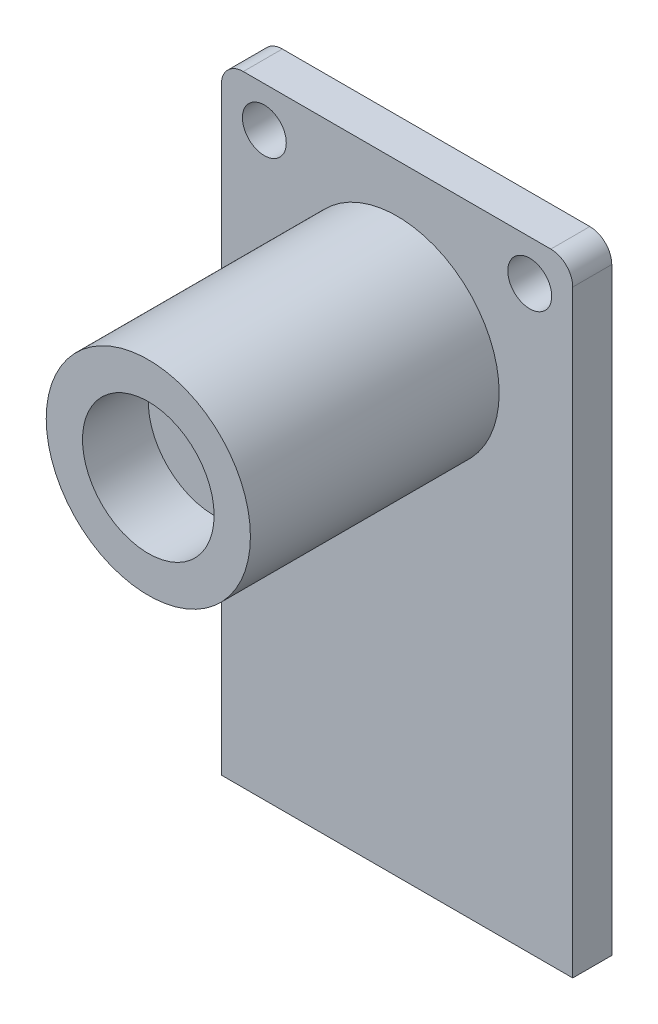
ISO-10303-21;
HEADER;
FILE_DESCRIPTION(('STEP AP214'),'2;1');
FILE_NAME('part.step','',(''),(''),'','','');
FILE_SCHEMA(('AUTOMOTIVE_DESIGN { 1 0 10303 214 1 1 1 1 }'));
ENDSEC;
DATA;
#1=APPLICATION_CONTEXT('core data for automotive mechanical design processes');
#2=APPLICATION_PROTOCOL_DEFINITION('international standard','automotive_design',2000,#1);
#3=PRODUCT_CONTEXT('',#1,'mechanical');
#4=PRODUCT('Part','Part','',(#3));
#5=PRODUCT_RELATED_PRODUCT_CATEGORY('part','',(#4));
#6=PRODUCT_DEFINITION_FORMATION('','',#4);
#7=PRODUCT_DEFINITION_CONTEXT('part definition',#1,'design');
#8=PRODUCT_DEFINITION('design','',#6,#7);
#9=PRODUCT_DEFINITION_SHAPE('','',#8);
#10=(LENGTH_UNIT() NAMED_UNIT(*) SI_UNIT(.MILLI.,.METRE.));
#11=(NAMED_UNIT(*) PLANE_ANGLE_UNIT() SI_UNIT($,.RADIAN.));
#12=(NAMED_UNIT(*) SI_UNIT($,.STERADIAN.) SOLID_ANGLE_UNIT());
#13=UNCERTAINTY_MEASURE_WITH_UNIT(LENGTH_MEASURE(1.E-05),#10,'distance_accuracy_value','');
#14=(GEOMETRIC_REPRESENTATION_CONTEXT(3) GLOBAL_UNCERTAINTY_ASSIGNED_CONTEXT((#13)) GLOBAL_UNIT_ASSIGNED_CONTEXT((#10,
#11,#12)) REPRESENTATION_CONTEXT('',''));
#15=CARTESIAN_POINT('',(0.,0.,0.));
#16=DIRECTION('',(0.,0.,1.));
#17=DIRECTION('',(1.,0.,0.));
#18=AXIS2_PLACEMENT_3D('',#15,#16,#17);
#19=CARTESIAN_POINT('',(8.01,-14.14,1.78));
#20=DIRECTION('',(-1.,0.,0.));
#21=DIRECTION('',(0.,0.,1.));
#22=AXIS2_PLACEMENT_3D('',#19,#20,#21);
#23=PLANE('',#22);
#24=DIRECTION('',(0.,1.,0.));
#25=VECTOR('',#24,1.);
#26=CARTESIAN_POINT('',(8.01,-14.14,0.));
#27=LINE('',#26,#25);
#28=CARTESIAN_POINT('',(8.01,-14.14,0.));
#29=VERTEX_POINT('',#28);
#30=CARTESIAN_POINT('',(8.01,13.14,0.));
#31=VERTEX_POINT('',#30);
#32=EDGE_CURVE('E120',#29,#31,#27,.T.);
#33=ORIENTED_EDGE('',*,*,#32,.T.);
#34=DIRECTION('',(0.,0.,-1.));
#35=VECTOR('',#34,1.);
#36=CARTESIAN_POINT('',(8.01,13.14,1.78));
#37=LINE('',#36,#35);
#38=CARTESIAN_POINT('',(8.01,13.14,1.78));
#39=VERTEX_POINT('',#38);
#40=EDGE_CURVE('E11',#39,#31,#37,.T.);
#41=ORIENTED_EDGE('',*,*,#40,.F.);
#42=DIRECTION('',(0.,1.,0.));
#43=VECTOR('',#42,1.);
#44=CARTESIAN_POINT('',(8.01,-14.14,1.78));
#45=LINE('',#44,#43);
#46=CARTESIAN_POINT('',(8.01,-14.14,1.78));
#47=VERTEX_POINT('',#46);
#48=EDGE_CURVE('E131',#47,#39,#45,.T.);
#49=ORIENTED_EDGE('',*,*,#48,.F.);
#50=DIRECTION('',(0.,0.,-1.));
#51=VECTOR('',#50,1.);
#52=CARTESIAN_POINT('',(8.01,-14.14,1.78));
#53=LINE('',#52,#51);
#54=EDGE_CURVE('E116',#47,#29,#53,.T.);
#55=ORIENTED_EDGE('',*,*,#54,.T.);
#56=EDGE_LOOP('',(#33,#41,#49,#55));
#57=FACE_BOUND('',#56,.T.);
#58=ADVANCED_FACE('F34',(#57),#23,.F.);
#59=CARTESIAN_POINT('',(7.01,13.14,1.78));
#60=DIRECTION('',(0.,0.,-1.));
#61=DIRECTION('',(-1.,0.,0.));
#62=AXIS2_PLACEMENT_3D('',#59,#60,#61);
#63=CYLINDRICAL_SURFACE('',#62,1.);
#64=CARTESIAN_POINT('',(7.01,13.14,0.));
#65=DIRECTION('',(0.,0.,1.));
#66=DIRECTION('',(1.,0.,0.));
#67=AXIS2_PLACEMENT_3D('',#64,#65,#66);
#68=CIRCLE('',#67,1.);
#69=CARTESIAN_POINT('',(7.00999999999999,14.14,0.));
#70=VERTEX_POINT('',#69);
#71=EDGE_CURVE('E123',#31,#70,#68,.T.);
#72=ORIENTED_EDGE('',*,*,#71,.T.);
#73=DIRECTION('',(0.,0.,-1.));
#74=VECTOR('',#73,1.);
#75=CARTESIAN_POINT('',(7.00999999999999,14.14,1.78));
#76=LINE('',#75,#74);
#77=CARTESIAN_POINT('',(7.00999999999999,14.14,1.78));
#78=VERTEX_POINT('',#77);
#79=EDGE_CURVE('E43',#78,#70,#76,.T.);
#80=ORIENTED_EDGE('',*,*,#79,.F.);
#81=CARTESIAN_POINT('',(7.01,13.14,1.78));
#82=DIRECTION('',(0.,0.,1.));
#83=DIRECTION('',(1.,0.,0.));
#84=AXIS2_PLACEMENT_3D('',#81,#82,#83);
#85=CIRCLE('',#84,1.);
#86=EDGE_CURVE('E89',#39,#78,#85,.T.);
#87=ORIENTED_EDGE('',*,*,#86,.F.);
#88=ORIENTED_EDGE('',*,*,#40,.T.);
#89=EDGE_LOOP('',(#72,#80,#87,#88));
#90=FACE_BOUND('',#89,.T.);
#91=ADVANCED_FACE('F164',(#90),#63,.T.);
#92=CARTESIAN_POINT('',(7.00999999999999,14.14,1.78));
#93=DIRECTION('',(0.,-1.,0.));
#94=DIRECTION('',(1.,0.,0.));
#95=AXIS2_PLACEMENT_3D('',#92,#93,#94);
#96=PLANE('',#95);
#97=DIRECTION('',(-1.,0.,0.));
#98=VECTOR('',#97,1.);
#99=CARTESIAN_POINT('',(7.00999999999999,14.14,0.));
#100=LINE('',#99,#98);
#101=CARTESIAN_POINT('',(-7.00999999999999,14.14,0.));
#102=VERTEX_POINT('',#101);
#103=EDGE_CURVE('E126',#70,#102,#100,.T.);
#104=ORIENTED_EDGE('',*,*,#103,.T.);
#105=DIRECTION('',(0.,0.,-1.));
#106=VECTOR('',#105,1.);
#107=CARTESIAN_POINT('',(-7.00999999999999,14.14,1.78));
#108=LINE('',#107,#106);
#109=CARTESIAN_POINT('',(-7.00999999999999,14.14,1.78));
#110=VERTEX_POINT('',#109);
#111=EDGE_CURVE('E111',#110,#102,#108,.T.);
#112=ORIENTED_EDGE('',*,*,#111,.F.);
#113=DIRECTION('',(-1.,0.,0.));
#114=VECTOR('',#113,1.);
#115=CARTESIAN_POINT('',(7.00999999999999,14.14,1.78));
#116=LINE('',#115,#114);
#117=EDGE_CURVE('E102',#78,#110,#116,.T.);
#118=ORIENTED_EDGE('',*,*,#117,.F.);
#119=ORIENTED_EDGE('',*,*,#79,.T.);
#120=EDGE_LOOP('',(#104,#112,#118,#119));
#121=FACE_BOUND('',#120,.T.);
#122=ADVANCED_FACE('F167',(#121),#96,.F.);
#123=CARTESIAN_POINT('',(-7.01,13.14,1.78));
#124=DIRECTION('',(0.,0.,-1.));
#125=DIRECTION('',(-1.,0.,0.));
#126=AXIS2_PLACEMENT_3D('',#123,#124,#125);
#127=CYLINDRICAL_SURFACE('',#126,1.);
#128=CARTESIAN_POINT('',(-7.01,13.14,0.));
#129=DIRECTION('',(0.,0.,1.));
#130=DIRECTION('',(-1.,0.,0.));
#131=AXIS2_PLACEMENT_3D('',#128,#129,#130);
#132=CIRCLE('',#131,1.);
#133=CARTESIAN_POINT('',(-8.01,13.14,0.));
#134=VERTEX_POINT('',#133);
#135=EDGE_CURVE('E110',#102,#134,#132,.T.);
#136=ORIENTED_EDGE('',*,*,#135,.T.);
#137=DIRECTION('',(0.,0.,-1.));
#138=VECTOR('',#137,1.);
#139=CARTESIAN_POINT('',(-8.01,13.14,1.78));
#140=LINE('',#139,#138);
#141=CARTESIAN_POINT('',(-8.01,13.14,1.78));
#142=VERTEX_POINT('',#141);
#143=EDGE_CURVE('E107',#142,#134,#140,.T.);
#144=ORIENTED_EDGE('',*,*,#143,.F.);
#145=CARTESIAN_POINT('',(-7.01,13.14,1.78));
#146=DIRECTION('',(0.,0.,1.));
#147=DIRECTION('',(-1.,0.,0.));
#148=AXIS2_PLACEMENT_3D('',#145,#146,#147);
#149=CIRCLE('',#148,1.);
#150=EDGE_CURVE('E96',#110,#142,#149,.T.);
#151=ORIENTED_EDGE('',*,*,#150,.F.);
#152=ORIENTED_EDGE('',*,*,#111,.T.);
#153=EDGE_LOOP('',(#136,#144,#151,#152));
#154=FACE_BOUND('',#153,.T.);
#155=ADVANCED_FACE('F108',(#154),#127,.T.);
#156=CARTESIAN_POINT('',(-8.01,-14.14,1.78));
#157=DIRECTION('',(1.,0.,0.));
#158=DIRECTION('',(0.,0.,-1.));
#159=AXIS2_PLACEMENT_3D('',#156,#157,#158);
#160=PLANE('',#159);
#161=DIRECTION('',(0.,-1.,0.));
#162=VECTOR('',#161,1.);
#163=CARTESIAN_POINT('',(-8.01,-14.14,0.));
#164=LINE('',#163,#162);
#165=CARTESIAN_POINT('',(-8.01,-14.14,0.));
#166=VERTEX_POINT('',#165);
#167=EDGE_CURVE('E75',#134,#166,#164,.T.);
#168=ORIENTED_EDGE('',*,*,#167,.T.);
#169=DIRECTION('',(0.,0.,-1.));
#170=VECTOR('',#169,1.);
#171=CARTESIAN_POINT('',(-8.01,-14.14,1.78));
#172=LINE('',#171,#170);
#173=CARTESIAN_POINT('',(-8.01,-14.14,1.78));
#174=VERTEX_POINT('',#173);
#175=EDGE_CURVE('E112',#174,#166,#172,.T.);
#176=ORIENTED_EDGE('',*,*,#175,.F.);
#177=DIRECTION('',(0.,-1.,0.));
#178=VECTOR('',#177,1.);
#179=CARTESIAN_POINT('',(-8.01,-14.14,1.78));
#180=LINE('',#179,#178);
#181=EDGE_CURVE('E100',#142,#174,#180,.T.);
#182=ORIENTED_EDGE('',*,*,#181,.F.);
#183=ORIENTED_EDGE('',*,*,#143,.T.);
#184=EDGE_LOOP('',(#168,#176,#182,#183));
#185=FACE_BOUND('',#184,.T.);
#186=ADVANCED_FACE('F114',(#185),#160,.F.);
#187=CARTESIAN_POINT('',(8.01,-14.14,1.78));
#188=DIRECTION('',(0.,1.,0.));
#189=DIRECTION('',(-1.,0.,0.));
#190=AXIS2_PLACEMENT_3D('',#187,#188,#189);
#191=PLANE('',#190);
#192=DIRECTION('',(1.,0.,0.));
#193=VECTOR('',#192,1.);
#194=CARTESIAN_POINT('',(8.01,-14.14,0.));
#195=LINE('',#194,#193);
#196=EDGE_CURVE('E81',#166,#29,#195,.T.);
#197=ORIENTED_EDGE('',*,*,#196,.T.);
#198=ORIENTED_EDGE('',*,*,#54,.F.);
#199=DIRECTION('',(1.,0.,0.));
#200=VECTOR('',#199,1.);
#201=CARTESIAN_POINT('',(8.01,-14.14,1.78));
#202=LINE('',#201,#200);
#203=EDGE_CURVE('E52',#174,#47,#202,.T.);
#204=ORIENTED_EDGE('',*,*,#203,.F.);
#205=ORIENTED_EDGE('',*,*,#175,.T.);
#206=EDGE_LOOP('',(#197,#198,#204,#205));
#207=FACE_BOUND('',#206,.T.);
#208=ADVANCED_FACE('F172',(#207),#191,.F.);
#209=CARTESIAN_POINT('',(7.01,13.14,1.78));
#210=DIRECTION('',(0.,0.,1.));
#211=DIRECTION('',(1.,0.,0.));
#212=AXIS2_PLACEMENT_3D('',#209,#210,#211);
#213=PLANE('',#212);
#214=CARTESIAN_POINT('',(-6.05,12.2998600123924,1.78));
#215=DIRECTION('',(0.,0.,1.));
#216=DIRECTION('',(-1.,0.,0.));
#217=AXIS2_PLACEMENT_3D('',#214,#215,#216);
#218=CIRCLE('',#217,0.999999999999998);
#219=CARTESIAN_POINT('',(-7.05,12.2998600123924,1.78));
#220=VERTEX_POINT('',#219);
#221=EDGE_CURVE('E138',#220,#220,#218,.T.);
#222=ORIENTED_EDGE('',*,*,#221,.F.);
#223=EDGE_LOOP('',(#222));
#224=FACE_BOUND('',#223,.T.);
#225=CARTESIAN_POINT('',(6.05,12.2998600123924,1.78));
#226=DIRECTION('',(0.,0.,1.));
#227=DIRECTION('',(1.,0.,0.));
#228=AXIS2_PLACEMENT_3D('',#225,#226,#227);
#229=CIRCLE('',#228,0.999999999999998);
#230=CARTESIAN_POINT('',(7.05,12.2998600123924,1.78));
#231=VERTEX_POINT('',#230);
#232=EDGE_CURVE('E144',#231,#231,#229,.T.);
#233=ORIENTED_EDGE('',*,*,#232,.F.);
#234=EDGE_LOOP('',(#233));
#235=FACE_BOUND('',#234,.T.);
#236=CARTESIAN_POINT('',(0.,7.285,1.78));
#237=DIRECTION('',(0.,0.,1.));
#238=DIRECTION('',(1.,0.,0.));
#239=AXIS2_PLACEMENT_3D('',#236,#237,#238);
#240=CIRCLE('',#239,4.655);
#241=CARTESIAN_POINT('',(4.655,7.285,1.78));
#242=VERTEX_POINT('',#241);
#243=EDGE_CURVE('E154',#242,#242,#240,.T.);
#244=ORIENTED_EDGE('',*,*,#243,.F.);
#245=EDGE_LOOP('',(#244));
#246=FACE_BOUND('',#245,.T.);
#247=ORIENTED_EDGE('',*,*,#48,.T.);
#248=ORIENTED_EDGE('',*,*,#86,.T.);
#249=ORIENTED_EDGE('',*,*,#117,.T.);
#250=ORIENTED_EDGE('',*,*,#150,.T.);
#251=ORIENTED_EDGE('',*,*,#181,.T.);
#252=ORIENTED_EDGE('',*,*,#203,.T.);
#253=EDGE_LOOP('',(#247,#248,#249,#250,#251,#252));
#254=FACE_BOUND('',#253,.T.);
#255=ADVANCED_FACE('F98',(#224,#235,#246,#254),#213,.T.);
#256=CARTESIAN_POINT('',(7.01,13.14,0.));
#257=DIRECTION('',(0.,0.,1.));
#258=DIRECTION('',(1.,0.,0.));
#259=AXIS2_PLACEMENT_3D('',#256,#257,#258);
#260=PLANE('',#259);
#261=CARTESIAN_POINT('',(-6.05,12.2998600123924,0.));
#262=DIRECTION('',(0.,0.,1.));
#263=DIRECTION('',(1.,0.,0.));
#264=AXIS2_PLACEMENT_3D('',#261,#262,#263);
#265=CIRCLE('',#264,0.999999999999998);
#266=CARTESIAN_POINT('',(-5.05,12.2998600123924,0.));
#267=VERTEX_POINT('',#266);
#268=EDGE_CURVE('E37',#267,#267,#265,.T.);
#269=ORIENTED_EDGE('',*,*,#268,.T.);
#270=EDGE_LOOP('',(#269));
#271=FACE_BOUND('',#270,.T.);
#272=CARTESIAN_POINT('',(6.05,12.2998600123924,0.));
#273=DIRECTION('',(0.,0.,1.));
#274=DIRECTION('',(1.,0.,0.));
#275=AXIS2_PLACEMENT_3D('',#272,#273,#274);
#276=CIRCLE('',#275,0.999999999999998);
#277=CARTESIAN_POINT('',(7.05,12.2998600123924,0.));
#278=VERTEX_POINT('',#277);
#279=EDGE_CURVE('E136',#278,#278,#276,.T.);
#280=ORIENTED_EDGE('',*,*,#279,.T.);
#281=EDGE_LOOP('',(#280));
#282=FACE_BOUND('',#281,.T.);
#283=ORIENTED_EDGE('',*,*,#32,.F.);
#284=ORIENTED_EDGE('',*,*,#196,.F.);
#285=ORIENTED_EDGE('',*,*,#167,.F.);
#286=ORIENTED_EDGE('',*,*,#135,.F.);
#287=ORIENTED_EDGE('',*,*,#103,.F.);
#288=ORIENTED_EDGE('',*,*,#71,.F.);
#289=EDGE_LOOP('',(#283,#284,#285,#286,#287,#288));
#290=FACE_BOUND('',#289,.T.);
#291=ADVANCED_FACE('F170',(#271,#282,#290),#260,.F.);
#292=CARTESIAN_POINT('',(0.,7.285,13.12));
#293=DIRECTION('',(0.,0.,-1.));
#294=DIRECTION('',(-1.,0.,0.));
#295=AXIS2_PLACEMENT_3D('',#292,#293,#294);
#296=CYLINDRICAL_SURFACE('',#295,4.655);
#297=CARTESIAN_POINT('',(0.,7.285,13.12));
#298=DIRECTION('',(0.,0.,1.));
#299=DIRECTION('',(1.,0.,0.));
#300=AXIS2_PLACEMENT_3D('',#297,#298,#299);
#301=CIRCLE('',#300,4.655);
#302=CARTESIAN_POINT('',(4.655,7.285,13.12));
#303=VERTEX_POINT('',#302);
#304=EDGE_CURVE('E124',#303,#303,#301,.T.);
#305=ORIENTED_EDGE('',*,*,#304,.F.);
#306=EDGE_LOOP('',(#305));
#307=FACE_BOUND('',#306,.T.);
#308=ORIENTED_EDGE('',*,*,#243,.T.);
#309=EDGE_LOOP('',(#308));
#310=FACE_BOUND('',#309,.T.);
#311=ADVANCED_FACE('F211',(#307,#310),#296,.T.);
#312=CARTESIAN_POINT('',(0.,7.285,13.12));
#313=DIRECTION('',(0.,0.,1.));
#314=DIRECTION('',(1.,0.,0.));
#315=AXIS2_PLACEMENT_3D('',#312,#313,#314);
#316=PLANE('',#315);
#317=CARTESIAN_POINT('',(0.,7.285,13.12));
#318=DIRECTION('',(0.,0.,1.));
#319=DIRECTION('',(1.,0.,0.));
#320=AXIS2_PLACEMENT_3D('',#317,#318,#319);
#321=CIRCLE('',#320,3.);
#322=CARTESIAN_POINT('',(3.,7.285,13.12));
#323=VERTEX_POINT('',#322);
#324=EDGE_CURVE('E142',#323,#323,#321,.T.);
#325=ORIENTED_EDGE('',*,*,#324,.F.);
#326=EDGE_LOOP('',(#325));
#327=FACE_BOUND('',#326,.T.);
#328=ORIENTED_EDGE('',*,*,#304,.T.);
#329=EDGE_LOOP('',(#328));
#330=FACE_BOUND('',#329,.T.);
#331=ADVANCED_FACE('F217',(#327,#330),#316,.T.);
#332=CARTESIAN_POINT('',(0.,7.285,10.12));
#333=DIRECTION('',(0.,0.,1.));
#334=DIRECTION('',(1.,0.,0.));
#335=AXIS2_PLACEMENT_3D('',#332,#333,#334);
#336=CYLINDRICAL_SURFACE('',#335,3.);
#337=CARTESIAN_POINT('',(0.,7.285,10.12));
#338=DIRECTION('',(0.,0.,1.));
#339=DIRECTION('',(1.,0.,0.));
#340=AXIS2_PLACEMENT_3D('',#337,#338,#339);
#341=CIRCLE('',#340,3.);
#342=CARTESIAN_POINT('',(3.,7.285,10.12));
#343=VERTEX_POINT('',#342);
#344=EDGE_CURVE('E151',#343,#343,#341,.T.);
#345=ORIENTED_EDGE('',*,*,#344,.F.);
#346=EDGE_LOOP('',(#345));
#347=FACE_BOUND('',#346,.T.);
#348=ORIENTED_EDGE('',*,*,#324,.T.);
#349=EDGE_LOOP('',(#348));
#350=FACE_BOUND('',#349,.T.);
#351=ADVANCED_FACE('F230',(#347,#350),#336,.F.);
#352=CARTESIAN_POINT('',(0.,7.285,10.12));
#353=DIRECTION('',(0.,0.,1.));
#354=DIRECTION('',(1.,0.,0.));
#355=AXIS2_PLACEMENT_3D('',#352,#353,#354);
#356=PLANE('',#355);
#357=ORIENTED_EDGE('',*,*,#344,.T.);
#358=EDGE_LOOP('',(#357));
#359=FACE_BOUND('',#358,.T.);
#360=ADVANCED_FACE('F240',(#359),#356,.T.);
#361=CARTESIAN_POINT('',(6.05,12.2998600123924,-1.22));
#362=DIRECTION('',(0.,0.,1.));
#363=DIRECTION('',(1.,0.,0.));
#364=AXIS2_PLACEMENT_3D('',#361,#362,#363);
#365=CYLINDRICAL_SURFACE('',#364,0.999999999999998);
#366=ORIENTED_EDGE('',*,*,#232,.T.);
#367=EDGE_LOOP('',(#366));
#368=FACE_BOUND('',#367,.T.);
#369=ORIENTED_EDGE('',*,*,#279,.F.);
#370=EDGE_LOOP('',(#369));
#371=FACE_BOUND('',#370,.T.);
#372=ADVANCED_FACE('F250',(#368,#371),#365,.F.);
#373=CARTESIAN_POINT('',(-6.05,12.2998600123924,-1.22));
#374=DIRECTION('',(0.,0.,1.));
#375=DIRECTION('',(1.,0.,0.));
#376=AXIS2_PLACEMENT_3D('',#373,#374,#375);
#377=CYLINDRICAL_SURFACE('',#376,0.999999999999998);
#378=ORIENTED_EDGE('',*,*,#221,.T.);
#379=EDGE_LOOP('',(#378));
#380=FACE_BOUND('',#379,.T.);
#381=ORIENTED_EDGE('',*,*,#268,.F.);
#382=EDGE_LOOP('',(#381));
#383=FACE_BOUND('',#382,.T.);
#384=ADVANCED_FACE('F272',(#380,#383),#377,.F.);
#385=CLOSED_SHELL('',(#58,#91,#122,#155,#186,#208,#255,#291,#311,#331,#351,#360,#372,#384));
#386=MANIFOLD_SOLID_BREP('B2',#385);
#387=ADVANCED_BREP_SHAPE_REPRESENTATION('',(#18,#386),#14);
#388=SHAPE_DEFINITION_REPRESENTATION(#9,#387);
ENDSEC;
END-ISO-10303-21;
